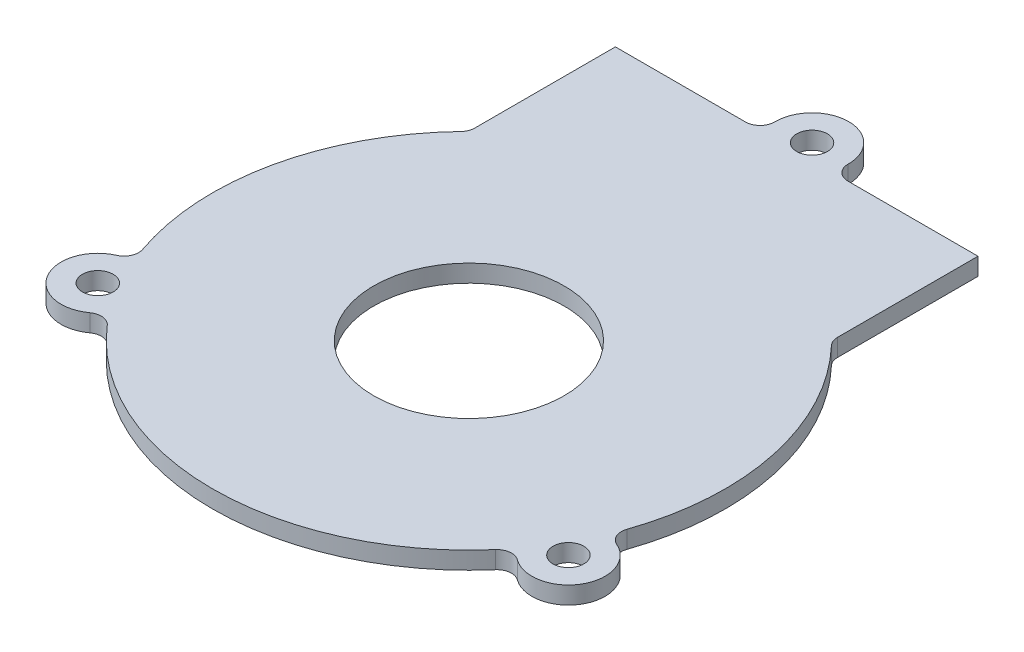
ISO-10303-21;
HEADER;
FILE_DESCRIPTION(('STEP AP214'),'2;1');
FILE_NAME('part.step','',(''),(''),'','','');
FILE_SCHEMA(('AUTOMOTIVE_DESIGN { 1 0 10303 214 1 1 1 1 }'));
ENDSEC;
DATA;
#1=APPLICATION_CONTEXT('core data for automotive mechanical design processes');
#2=APPLICATION_PROTOCOL_DEFINITION('international standard','automotive_design',2000,#1);
#3=PRODUCT_CONTEXT('',#1,'mechanical');
#4=PRODUCT('Part','Part','',(#3));
#5=PRODUCT_RELATED_PRODUCT_CATEGORY('part','',(#4));
#6=PRODUCT_DEFINITION_FORMATION('','',#4);
#7=PRODUCT_DEFINITION_CONTEXT('part definition',#1,'design');
#8=PRODUCT_DEFINITION('design','',#6,#7);
#9=PRODUCT_DEFINITION_SHAPE('','',#8);
#10=(LENGTH_UNIT() NAMED_UNIT(*) SI_UNIT(.MILLI.,.METRE.));
#11=(NAMED_UNIT(*) PLANE_ANGLE_UNIT() SI_UNIT($,.RADIAN.));
#12=(NAMED_UNIT(*) SI_UNIT($,.STERADIAN.) SOLID_ANGLE_UNIT());
#13=UNCERTAINTY_MEASURE_WITH_UNIT(LENGTH_MEASURE(1.E-05),#10,'distance_accuracy_value','');
#14=(GEOMETRIC_REPRESENTATION_CONTEXT(3) GLOBAL_UNCERTAINTY_ASSIGNED_CONTEXT((#13)) GLOBAL_UNIT_ASSIGNED_CONTEXT((#10,
#11,#12)) REPRESENTATION_CONTEXT('',''));
#15=CARTESIAN_POINT('',(0.,0.,0.));
#16=DIRECTION('',(0.,0.,1.));
#17=DIRECTION('',(1.,0.,0.));
#18=AXIS2_PLACEMENT_3D('',#15,#16,#17);
#19=CARTESIAN_POINT('',(0.,2.38125,0.));
#20=DIRECTION('',(0.,-1.,0.));
#21=DIRECTION('',(0.,0.,-1.));
#22=AXIS2_PLACEMENT_3D('',#19,#20,#21);
#23=CYLINDRICAL_SURFACE('',#22,35.);
#24=CARTESIAN_POINT('',(0.,0.,0.));
#25=DIRECTION('',(0.,1.,0.));
#26=DIRECTION('',(0.,0.,1.));
#27=AXIS2_PLACEMENT_3D('',#24,#25,#26);
#28=CIRCLE('',#27,35.);
#29=CARTESIAN_POINT('',(-25.3019754085747,0.,-24.1828459951239));
#30=VERTEX_POINT('',#29);
#31=CARTESIAN_POINT('',(-33.072840065109,0.,11.4537002766671));
#32=VERTEX_POINT('',#31);
#33=EDGE_CURVE('E211',#30,#32,#28,.T.);
#34=ORIENTED_EDGE('',*,*,#33,.T.);
#35=DIRECTION('',(0.,-1.,0.));
#36=VECTOR('',#35,1.);
#37=CARTESIAN_POINT('',(-33.072840065109,2.38125,11.4537002766671));
#38=LINE('',#37,#36);
#39=CARTESIAN_POINT('',(-33.072840065109,2.38125,11.4537002766671));
#40=VERTEX_POINT('',#39);
#41=EDGE_CURVE('E224',#32,#40,#38,.F.);
#42=ORIENTED_EDGE('',*,*,#41,.T.);
#43=CARTESIAN_POINT('',(0.,2.38125,0.));
#44=DIRECTION('',(0.,1.,0.));
#45=DIRECTION('',(0.,0.,1.));
#46=AXIS2_PLACEMENT_3D('',#43,#44,#45);
#47=CIRCLE('',#46,35.);
#48=CARTESIAN_POINT('',(-25.3019754085747,2.38125,-24.1828459951239));
#49=VERTEX_POINT('',#48);
#50=EDGE_CURVE('E205',#49,#40,#47,.T.);
#51=ORIENTED_EDGE('',*,*,#50,.F.);
#52=DIRECTION('',(0.,-1.,0.));
#53=VECTOR('',#52,1.);
#54=CARTESIAN_POINT('',(-25.3019754085747,2.38125,-24.1828459951239));
#55=LINE('',#54,#53);
#56=EDGE_CURVE('E218',#49,#30,#55,.T.);
#57=ORIENTED_EDGE('',*,*,#56,.T.);
#58=EDGE_LOOP('',(#34,#42,#51,#57));
#59=FACE_BOUND('',#58,.T.);
#60=ADVANCED_FACE('F43',(#59),#23,.T.);
#61=CARTESIAN_POINT('',(-26.5021889393046,0.,22.8611894140572));
#62=VERTEX_POINT('',#61);
#63=CARTESIAN_POINT('',(26.4887144081727,0.,22.8768006723464));
#64=VERTEX_POINT('',#63);
#65=EDGE_CURVE('E214',#62,#64,#28,.T.);
#66=ORIENTED_EDGE('',*,*,#65,.T.);
#67=DIRECTION('',(0.,-1.,0.));
#68=VECTOR('',#67,1.);
#69=CARTESIAN_POINT('',(26.4887144081726,2.38125,22.8768006723464));
#70=LINE('',#69,#68);
#71=CARTESIAN_POINT('',(26.4887144081727,2.38125,22.8768006723464));
#72=VERTEX_POINT('',#71);
#73=EDGE_CURVE('E243',#64,#72,#70,.F.);
#74=ORIENTED_EDGE('',*,*,#73,.T.);
#75=CARTESIAN_POINT('',(-26.5021889393046,2.38125,22.8611894140572));
#76=VERTEX_POINT('',#75);
#77=EDGE_CURVE('E209',#76,#72,#47,.T.);
#78=ORIENTED_EDGE('',*,*,#77,.F.);
#79=DIRECTION('',(0.,-1.,0.));
#80=VECTOR('',#79,1.);
#81=CARTESIAN_POINT('',(-26.5021889393046,2.38125,22.8611894140572));
#82=LINE('',#81,#80);
#83=EDGE_CURVE('E234',#76,#62,#82,.T.);
#84=ORIENTED_EDGE('',*,*,#83,.T.);
#85=EDGE_LOOP('',(#66,#74,#78,#84));
#86=FACE_BOUND('',#85,.T.);
#87=ADVANCED_FACE('F366',(#86),#23,.T.);
#88=CARTESIAN_POINT('',(-24.7478605121482,-53.381962685779,-44.7452325826062));
#89=DIRECTION('',(3.0206381024394E-06,0.,0.999999999995438));
#90=DIRECTION('',(0.999999999995438,0.,-3.0206381024394E-06));
#91=AXIS2_PLACEMENT_3D('',#88,#89,#90);
#92=PLANE('',#91);
#93=DIRECTION('',(0.999999999995438,0.,-3.0206381024394E-06));
#94=VECTOR('',#93,1.);
#95=CARTESIAN_POINT('',(-24.7478605121482,2.38125,-44.7452325826062));
#96=LINE('',#95,#94);
#97=CARTESIAN_POINT('',(-24.7478605121482,2.38125,-44.7452325826062));
#98=VERTEX_POINT('',#97);
#99=CARTESIAN_POINT('',(-6.99532394188785,2.38125,-44.7452862065945));
#100=VERTEX_POINT('',#99);
#101=EDGE_CURVE('E177',#98,#100,#96,.T.);
#102=ORIENTED_EDGE('',*,*,#101,.T.);
#103=DIRECTION('',(0.,1.,0.));
#104=VECTOR('',#103,1.);
#105=CARTESIAN_POINT('',(-6.99532394188785,-53.381962685779,-44.7452862065945));
#106=LINE('',#105,#104);
#107=CARTESIAN_POINT('',(-6.99532394188785,0.,-44.7452862065945));
#108=VERTEX_POINT('',#107);
#109=EDGE_CURVE('E278',#100,#108,#106,.F.);
#110=ORIENTED_EDGE('',*,*,#109,.T.);
#111=DIRECTION('',(-0.999999999995438,0.,3.0206381024394E-06));
#112=VECTOR('',#111,1.);
#113=CARTESIAN_POINT('',(-24.7478605121482,0.,-44.7452325826062));
#114=LINE('',#113,#112);
#115=CARTESIAN_POINT('',(-24.7478605121482,0.,-44.7452325826062));
#116=VERTEX_POINT('',#115);
#117=EDGE_CURVE('E198',#108,#116,#114,.T.);
#118=ORIENTED_EDGE('',*,*,#117,.T.);
#119=DIRECTION('',(0.,1.,0.));
#120=VECTOR('',#119,1.);
#121=CARTESIAN_POINT('',(-24.7478605121482,-53.381962685779,-44.7452325826062));
#122=LINE('',#121,#120);
#123=EDGE_CURVE('E194',#116,#98,#122,.T.);
#124=ORIENTED_EDGE('',*,*,#123,.T.);
#125=EDGE_LOOP('',(#102,#110,#118,#124));
#126=FACE_BOUND('',#125,.T.);
#127=ADVANCED_FACE('F284',(#126),#92,.F.);
#128=CARTESIAN_POINT('',(33.0630730181294,0.,11.4818640733046));
#129=VERTEX_POINT('',#128);
#130=CARTESIAN_POINT('',(25.3018293128609,0.,-24.1829988509046));
#131=VERTEX_POINT('',#130);
#132=EDGE_CURVE('E215',#129,#131,#28,.T.);
#133=ORIENTED_EDGE('',*,*,#132,.T.);
#134=DIRECTION('',(0.,-1.,0.));
#135=VECTOR('',#134,1.);
#136=CARTESIAN_POINT('',(25.3018293128609,2.38125,-24.1829988509046));
#137=LINE('',#136,#135);
#138=CARTESIAN_POINT('',(25.3018293128609,2.38125,-24.1829988509046));
#139=VERTEX_POINT('',#138);
#140=EDGE_CURVE('E262',#131,#139,#137,.F.);
#141=ORIENTED_EDGE('',*,*,#140,.T.);
#142=CARTESIAN_POINT('',(33.0630730181294,2.38125,11.4818640733046));
#143=VERTEX_POINT('',#142);
#144=EDGE_CURVE('E210',#143,#139,#47,.T.);
#145=ORIENTED_EDGE('',*,*,#144,.F.);
#146=DIRECTION('',(0.,-1.,0.));
#147=VECTOR('',#146,1.);
#148=CARTESIAN_POINT('',(33.0630730181294,2.38125,11.4818640733046));
#149=LINE('',#148,#147);
#150=EDGE_CURVE('E253',#143,#129,#149,.T.);
#151=ORIENTED_EDGE('',*,*,#150,.T.);
#152=EDGE_LOOP('',(#133,#141,#145,#151));
#153=FACE_BOUND('',#152,.T.);
#154=ADVANCED_FACE('F343',(#153),#23,.T.);
#155=CARTESIAN_POINT('',(0.,2.38125,0.));
#156=DIRECTION('',(0.,1.,0.));
#157=DIRECTION('',(0.,0.,1.));
#158=AXIS2_PLACEMENT_3D('',#155,#156,#157);
#159=PLANE('',#158);
#160=CARTESIAN_POINT('',(0.,2.38125,0.));
#161=DIRECTION('',(0.,1.,0.));
#162=DIRECTION('',(0.,0.,1.));
#163=AXIS2_PLACEMENT_3D('',#160,#161,#162);
#164=CIRCLE('',#163,13.);
#165=CARTESIAN_POINT('',(0.,2.38125,13.));
#166=VERTEX_POINT('',#165);
#167=EDGE_CURVE('E335',#166,#166,#164,.T.);
#168=ORIENTED_EDGE('',*,*,#167,.F.);
#169=EDGE_LOOP('',(#168));
#170=FACE_BOUND('',#169,.T.);
#171=CARTESIAN_POINT('',(-32.1480166138315,2.38125,18.5087961651664));
#172=DIRECTION('',(0.,1.,0.));
#173=DIRECTION('',(0.,0.,1.));
#174=AXIS2_PLACEMENT_3D('',#171,#172,#173);
#175=CIRCLE('',#174,2.09999999999999);
#176=CARTESIAN_POINT('',(-32.1480166138315,2.38125,20.6087961651664));
#177=VERTEX_POINT('',#176);
#178=EDGE_CURVE('E329',#177,#177,#175,.T.);
#179=ORIENTED_EDGE('',*,*,#178,.F.);
#180=EDGE_LOOP('',(#179));
#181=FACE_BOUND('',#180,.T.);
#182=DIRECTION('',(-3.02063810260161E-06,0.,-0.999999999995438));
#183=VECTOR('',#182,1.);
#184=CARTESIAN_POINT('',(-24.7478001128037,2.38125,-24.7496745347634));
#185=LINE('',#184,#183);
#186=CARTESIAN_POINT('',(-24.7478025747881,2.38125,-25.5647289504072));
#187=VERTEX_POINT('',#186);
#188=EDGE_CURVE('E195',#187,#98,#185,.T.);
#189=ORIENTED_EDGE('',*,*,#188,.F.);
#190=CARTESIAN_POINT('',(-26.747802574779,2.38125,-25.564722909131));
#191=DIRECTION('',(0.,1.,0.));
#192=DIRECTION('',(0.,0.,1.));
#193=AXIS2_PLACEMENT_3D('',#190,#191,#192);
#194=CIRCLE('',#193,2.);
#195=EDGE_CURVE('E220',#187,#49,#194,.F.);
#196=ORIENTED_EDGE('',*,*,#195,.T.);
#197=ORIENTED_EDGE('',*,*,#50,.T.);
#198=CARTESIAN_POINT('',(-34.9627166402581,2.38125,12.1081974353338));
#199=DIRECTION('',(0.,1.,0.));
#200=DIRECTION('',(0.,0.,1.));
#201=AXIS2_PLACEMENT_3D('',#198,#199,#200);
#202=CIRCLE('',#201,2.);
#203=CARTESIAN_POINT('',(-34.1580179965192,2.38125,13.9391698799011));
#204=VERTEX_POINT('',#203);
#205=EDGE_CURVE('E230',#40,#204,#202,.F.);
#206=ORIENTED_EDGE('',*,*,#205,.T.);
#207=CARTESIAN_POINT('',(-32.1464555555357,2.38125,18.5161819435163));
#208=DIRECTION('',(0.,1.,0.));
#209=DIRECTION('',(0.,0.,1.));
#210=AXIS2_PLACEMENT_3D('',#207,#208,#209);
#211=CIRCLE('',#210,4.99954226749351);
#212=CARTESIAN_POINT('',(-29.1966357044392,2.38125,22.5527628891349));
#213=VERTEX_POINT('',#212);
#214=EDGE_CURVE('E323',#204,#213,#211,.T.);
#215=ORIENTED_EDGE('',*,*,#214,.T.);
#216=CARTESIAN_POINT('',(-28.0165997358363,2.38125,24.1675430948605));
#217=DIRECTION('',(0.,1.,0.));
#218=DIRECTION('',(0.,0.,1.));
#219=AXIS2_PLACEMENT_3D('',#216,#217,#218);
#220=CIRCLE('',#219,2.);
#221=EDGE_CURVE('E241',#213,#76,#220,.F.);
#222=ORIENTED_EDGE('',*,*,#221,.T.);
#223=ORIENTED_EDGE('',*,*,#77,.T.);
#224=CARTESIAN_POINT('',(28.0023552314968,2.38125,24.1840464250519));
#225=DIRECTION('',(0.,1.,0.));
#226=DIRECTION('',(0.,0.,1.));
#227=AXIS2_PLACEMENT_3D('',#224,#225,#226);
#228=CIRCLE('',#227,2.);
#229=CARTESIAN_POINT('',(29.184359284545,2.38125,22.5707062815676));
#230=VERTEX_POINT('',#229);
#231=EDGE_CURVE('E249',#72,#230,#228,.F.);
#232=ORIENTED_EDGE('',*,*,#231,.T.);
#233=CARTESIAN_POINT('',(32.1364886347761,2.38125,18.5412879583363));
#234=DIRECTION('',(0.,1.,0.));
#235=DIRECTION('',(0.,0.,1.));
#236=AXIS2_PLACEMENT_3D('',#233,#234,#235);
#237=CIRCLE('',#236,4.9951255964279);
#238=CARTESIAN_POINT('',(34.147287178261,2.38125,13.9687647007018));
#239=VERTEX_POINT('',#238);
#240=EDGE_CURVE('E312',#230,#239,#237,.T.);
#241=ORIENTED_EDGE('',*,*,#240,.T.);
#242=CARTESIAN_POINT('',(34.9523914763083,2.38125,12.1379705917791));
#243=DIRECTION('',(0.,1.,0.));
#244=DIRECTION('',(0.,0.,1.));
#245=AXIS2_PLACEMENT_3D('',#242,#243,#244);
#246=CIRCLE('',#245,2.);
#247=EDGE_CURVE('E260',#239,#143,#246,.F.);
#248=ORIENTED_EDGE('',*,*,#247,.T.);
#249=ORIENTED_EDGE('',*,*,#144,.T.);
#250=CARTESIAN_POINT('',(26.7476481307387,2.38125,-25.5648844995277));
#251=DIRECTION('',(0.,1.,0.));
#252=DIRECTION('',(0.,0.,1.));
#253=AXIS2_PLACEMENT_3D('',#250,#251,#252);
#254=CIRCLE('',#253,2.);
#255=CARTESIAN_POINT('',(24.7476481307478,2.38125,-25.5648784582515));
#256=VERTEX_POINT('',#255);
#257=EDGE_CURVE('E185',#139,#256,#254,.F.);
#258=ORIENTED_EDGE('',*,*,#257,.T.);
#259=DIRECTION('',(-3.02063810260161E-06,0.,-0.999999999995438));
#260=VECTOR('',#259,1.);
#261=CARTESIAN_POINT('',(24.7476505927322,2.38125,-24.7498240426077));
#262=LINE('',#261,#260);
#263=CARTESIAN_POINT('',(24.7475901933877,2.38125,-44.7453820904505));
#264=VERTEX_POINT('',#263);
#265=EDGE_CURVE('E178',#256,#264,#262,.T.);
#266=ORIENTED_EDGE('',*,*,#265,.T.);
#267=CARTESIAN_POINT('',(6.99533660471705,2.38125,-44.7453284673169));
#268=VERTEX_POINT('',#267);
#269=EDGE_CURVE('E168',#268,#264,#96,.T.);
#270=ORIENTED_EDGE('',*,*,#269,.F.);
#271=CARTESIAN_POINT('',(6.99533056344084,2.38125,-46.7453284673078));
#272=DIRECTION('',(0.,1.,0.));
#273=DIRECTION('',(0.,0.,1.));
#274=AXIS2_PLACEMENT_3D('',#271,#272,#273);
#275=CIRCLE('',#274,2.);
#276=CARTESIAN_POINT('',(4.99551899083441,2.38125,-46.7727815922561));
#277=VERTEX_POINT('',#276);
#278=EDGE_CURVE('E274',#268,#277,#275,.F.);
#279=ORIENTED_EDGE('',*,*,#278,.T.);
#280=CARTESIAN_POINT('',(0.,2.38125,-46.8413593567393));
#281=DIRECTION('',(0.,1.,0.));
#282=DIRECTION('',(0.,0.,1.));
#283=AXIS2_PLACEMENT_3D('',#280,#281,#282);
#284=CIRCLE('',#283,4.99598968149142);
#285=CARTESIAN_POINT('',(-4.99551857644603,2.38125,-46.7727514129473));
#286=VERTEX_POINT('',#285);
#287=EDGE_CURVE('E304',#277,#286,#284,.T.);
#288=ORIENTED_EDGE('',*,*,#287,.T.);
#289=CARTESIAN_POINT('',(-6.99532998316405,2.38125,-46.7452862065854));
#290=DIRECTION('',(0.,1.,0.));
#291=DIRECTION('',(0.,0.,1.));
#292=AXIS2_PLACEMENT_3D('',#289,#290,#291);
#293=CIRCLE('',#292,2.);
#294=EDGE_CURVE('E12',#286,#100,#293,.F.);
#295=ORIENTED_EDGE('',*,*,#294,.T.);
#296=ORIENTED_EDGE('',*,*,#101,.F.);
#297=EDGE_LOOP('',(#189,#196,#197,#206,#215,#222,#223,#232,#241,#248,#249,#258,#266,#270,#279,
#288,#295,#296));
#298=FACE_BOUND('',#297,.T.);
#299=CARTESIAN_POINT('',(32.1247811991366,2.38125,18.5356173256723));
#300=DIRECTION('',(0.,1.,0.));
#301=DIRECTION('',(0.,0.,1.));
#302=AXIS2_PLACEMENT_3D('',#299,#300,#301);
#303=CIRCLE('',#302,2.1);
#304=CARTESIAN_POINT('',(32.1247811991366,2.38125,20.6356173256723));
#305=VERTEX_POINT('',#304);
#306=EDGE_CURVE('E318',#305,#305,#303,.T.);
#307=ORIENTED_EDGE('',*,*,#306,.F.);
#308=EDGE_LOOP('',(#307));
#309=FACE_BOUND('',#308,.T.);
#310=CARTESIAN_POINT('',(0.,2.38125,-46.8413593567393));
#311=DIRECTION('',(0.,1.,0.));
#312=DIRECTION('',(0.,0.,1.));
#313=AXIS2_PLACEMENT_3D('',#310,#311,#312);
#314=CIRCLE('',#313,2.09605202456873);
#315=CARTESIAN_POINT('',(0.,2.38125,-44.7453073321706));
#316=VERTEX_POINT('',#315);
#317=EDGE_CURVE('E306',#316,#316,#314,.T.);
#318=ORIENTED_EDGE('',*,*,#317,.F.);
#319=EDGE_LOOP('',(#318));
#320=FACE_BOUND('',#319,.T.);
#321=ADVANCED_FACE('F182',(#170,#181,#298,#309,#320),#159,.T.);
#322=CARTESIAN_POINT('',(0.,0.,0.));
#323=DIRECTION('',(0.,1.,0.));
#324=DIRECTION('',(0.,0.,1.));
#325=AXIS2_PLACEMENT_3D('',#322,#323,#324);
#326=PLANE('',#325);
#327=CARTESIAN_POINT('',(0.,0.,0.));
#328=DIRECTION('',(0.,1.,0.));
#329=DIRECTION('',(0.,0.,1.));
#330=AXIS2_PLACEMENT_3D('',#327,#328,#329);
#331=CIRCLE('',#330,13.);
#332=CARTESIAN_POINT('',(0.,0.,13.));
#333=VERTEX_POINT('',#332);
#334=EDGE_CURVE('E332',#333,#333,#331,.F.);
#335=ORIENTED_EDGE('',*,*,#334,.F.);
#336=EDGE_LOOP('',(#335));
#337=FACE_BOUND('',#336,.T.);
#338=CARTESIAN_POINT('',(-32.1480166138315,0.,18.5087961651664));
#339=DIRECTION('',(0.,1.,0.));
#340=DIRECTION('',(0.,0.,1.));
#341=AXIS2_PLACEMENT_3D('',#338,#339,#340);
#342=CIRCLE('',#341,2.1);
#343=CARTESIAN_POINT('',(-32.1480166138315,0.,20.6087961651664));
#344=VERTEX_POINT('',#343);
#345=EDGE_CURVE('E326',#344,#344,#342,.T.);
#346=ORIENTED_EDGE('',*,*,#345,.T.);
#347=EDGE_LOOP('',(#346));
#348=FACE_BOUND('',#347,.T.);
#349=CARTESIAN_POINT('',(32.1247811991366,0.,18.5356173256723));
#350=DIRECTION('',(0.,1.,0.));
#351=DIRECTION('',(0.,0.,1.));
#352=AXIS2_PLACEMENT_3D('',#349,#350,#351);
#353=CIRCLE('',#352,2.1);
#354=CARTESIAN_POINT('',(32.1247811991366,0.,20.6356173256723));
#355=VERTEX_POINT('',#354);
#356=EDGE_CURVE('E315',#355,#355,#353,.T.);
#357=ORIENTED_EDGE('',*,*,#356,.T.);
#358=EDGE_LOOP('',(#357));
#359=FACE_BOUND('',#358,.T.);
#360=CARTESIAN_POINT('',(0.,0.,-46.8413593567393));
#361=DIRECTION('',(0.,1.,0.));
#362=DIRECTION('',(0.,0.,1.));
#363=AXIS2_PLACEMENT_3D('',#360,#361,#362);
#364=CIRCLE('',#363,2.09605202456873);
#365=CARTESIAN_POINT('',(0.,0.,-44.7453073321706));
#366=VERTEX_POINT('',#365);
#367=EDGE_CURVE('E188',#366,#366,#364,.F.);
#368=ORIENTED_EDGE('',*,*,#367,.F.);
#369=EDGE_LOOP('',(#368));
#370=FACE_BOUND('',#369,.T.);
#371=ORIENTED_EDGE('',*,*,#65,.F.);
#372=CARTESIAN_POINT('',(-28.0165997358363,0.,24.1675430948605));
#373=DIRECTION('',(0.,1.,0.));
#374=DIRECTION('',(0.,0.,1.));
#375=AXIS2_PLACEMENT_3D('',#372,#373,#374);
#376=CIRCLE('',#375,2.);
#377=CARTESIAN_POINT('',(-29.1966357044392,0.,22.5527628891349));
#378=VERTEX_POINT('',#377);
#379=EDGE_CURVE('E239',#62,#378,#376,.T.);
#380=ORIENTED_EDGE('',*,*,#379,.T.);
#381=CARTESIAN_POINT('',(-32.1464555555357,0.,18.5161819435163));
#382=DIRECTION('',(0.,1.,0.));
#383=DIRECTION('',(0.,0.,1.));
#384=AXIS2_PLACEMENT_3D('',#381,#382,#383);
#385=CIRCLE('',#384,4.99954226749351);
#386=CARTESIAN_POINT('',(-34.1580179965192,0.,13.9391698799011));
#387=VERTEX_POINT('',#386);
#388=EDGE_CURVE('E321',#378,#387,#385,.F.);
#389=ORIENTED_EDGE('',*,*,#388,.T.);
#390=CARTESIAN_POINT('',(-34.9627166402581,0.,12.1081974353338));
#391=DIRECTION('',(0.,1.,0.));
#392=DIRECTION('',(0.,0.,1.));
#393=AXIS2_PLACEMENT_3D('',#390,#391,#392);
#394=CIRCLE('',#393,2.);
#395=EDGE_CURVE('E232',#387,#32,#394,.T.);
#396=ORIENTED_EDGE('',*,*,#395,.T.);
#397=ORIENTED_EDGE('',*,*,#33,.F.);
#398=CARTESIAN_POINT('',(-26.747802574779,0.,-25.564722909131));
#399=DIRECTION('',(0.,1.,0.));
#400=DIRECTION('',(0.,0.,1.));
#401=AXIS2_PLACEMENT_3D('',#398,#399,#400);
#402=CIRCLE('',#401,2.);
#403=CARTESIAN_POINT('',(-24.7478025747881,0.,-25.5647289504072));
#404=VERTEX_POINT('',#403);
#405=EDGE_CURVE('E222',#30,#404,#402,.T.);
#406=ORIENTED_EDGE('',*,*,#405,.T.);
#407=DIRECTION('',(3.02063810260161E-06,0.,0.999999999995438));
#408=VECTOR('',#407,1.);
#409=CARTESIAN_POINT('',(-24.7478001128037,0.,-24.7496745347634));
#410=LINE('',#409,#408);
#411=EDGE_CURVE('E204',#116,#404,#410,.T.);
#412=ORIENTED_EDGE('',*,*,#411,.F.);
#413=ORIENTED_EDGE('',*,*,#117,.F.);
#414=CARTESIAN_POINT('',(-6.99532998316405,0.,-46.7452862065854));
#415=DIRECTION('',(0.,1.,0.));
#416=DIRECTION('',(0.,0.,1.));
#417=AXIS2_PLACEMENT_3D('',#414,#415,#416);
#418=CIRCLE('',#417,2.);
#419=CARTESIAN_POINT('',(-4.99551857644603,0.,-46.7727514129473));
#420=VERTEX_POINT('',#419);
#421=EDGE_CURVE('E51',#108,#420,#418,.T.);
#422=ORIENTED_EDGE('',*,*,#421,.T.);
#423=CARTESIAN_POINT('',(0.,0.,-46.8413593567393));
#424=DIRECTION('',(0.,1.,0.));
#425=DIRECTION('',(0.,0.,1.));
#426=AXIS2_PLACEMENT_3D('',#423,#424,#425);
#427=CIRCLE('',#426,4.99598968149142);
#428=CARTESIAN_POINT('',(4.99551899083441,0.,-46.7727815922561));
#429=VERTEX_POINT('',#428);
#430=EDGE_CURVE('E303',#420,#429,#427,.F.);
#431=ORIENTED_EDGE('',*,*,#430,.T.);
#432=CARTESIAN_POINT('',(6.99533056344084,0.,-46.7453284673078));
#433=DIRECTION('',(0.,1.,0.));
#434=DIRECTION('',(0.,0.,1.));
#435=AXIS2_PLACEMENT_3D('',#432,#433,#434);
#436=CIRCLE('',#435,2.);
#437=CARTESIAN_POINT('',(6.99533660471705,0.,-44.7453284673169));
#438=VERTEX_POINT('',#437);
#439=EDGE_CURVE('E276',#429,#438,#436,.T.);
#440=ORIENTED_EDGE('',*,*,#439,.T.);
#441=CARTESIAN_POINT('',(24.7475901933877,0.,-44.7453820904505));
#442=VERTEX_POINT('',#441);
#443=EDGE_CURVE('E202',#442,#438,#114,.T.);
#444=ORIENTED_EDGE('',*,*,#443,.F.);
#445=DIRECTION('',(3.02063810260161E-06,0.,0.999999999995438));
#446=VECTOR('',#445,1.);
#447=CARTESIAN_POINT('',(24.7476505927322,0.,-24.7498240426077));
#448=LINE('',#447,#446);
#449=CARTESIAN_POINT('',(24.7476481307478,0.,-25.5648784582515));
#450=VERTEX_POINT('',#449);
#451=EDGE_CURVE('E193',#442,#450,#448,.T.);
#452=ORIENTED_EDGE('',*,*,#451,.T.);
#453=CARTESIAN_POINT('',(26.7476481307387,0.,-25.5648844995277));
#454=DIRECTION('',(0.,1.,0.));
#455=DIRECTION('',(0.,0.,1.));
#456=AXIS2_PLACEMENT_3D('',#453,#454,#455);
#457=CIRCLE('',#456,2.);
#458=EDGE_CURVE('E268',#450,#131,#457,.T.);
#459=ORIENTED_EDGE('',*,*,#458,.T.);
#460=ORIENTED_EDGE('',*,*,#132,.F.);
#461=CARTESIAN_POINT('',(34.9523914763083,0.,12.1379705917791));
#462=DIRECTION('',(0.,1.,0.));
#463=DIRECTION('',(0.,0.,1.));
#464=AXIS2_PLACEMENT_3D('',#461,#462,#463);
#465=CIRCLE('',#464,2.);
#466=CARTESIAN_POINT('',(34.147287178261,0.,13.9687647007018));
#467=VERTEX_POINT('',#466);
#468=EDGE_CURVE('E258',#129,#467,#465,.T.);
#469=ORIENTED_EDGE('',*,*,#468,.T.);
#470=CARTESIAN_POINT('',(32.1364886347761,0.,18.5412879583363));
#471=DIRECTION('',(0.,1.,0.));
#472=DIRECTION('',(0.,0.,1.));
#473=AXIS2_PLACEMENT_3D('',#470,#471,#472);
#474=CIRCLE('',#473,4.9951255964279);
#475=CARTESIAN_POINT('',(29.184359284545,0.,22.5707062815676));
#476=VERTEX_POINT('',#475);
#477=EDGE_CURVE('E309',#467,#476,#474,.F.);
#478=ORIENTED_EDGE('',*,*,#477,.T.);
#479=CARTESIAN_POINT('',(28.0023552314968,0.,24.1840464250519));
#480=DIRECTION('',(0.,1.,0.));
#481=DIRECTION('',(0.,0.,1.));
#482=AXIS2_PLACEMENT_3D('',#479,#480,#481);
#483=CIRCLE('',#482,2.);
#484=EDGE_CURVE('E251',#476,#64,#483,.T.);
#485=ORIENTED_EDGE('',*,*,#484,.T.);
#486=EDGE_LOOP('',(#371,#380,#389,#396,#397,#406,#412,#413,#422,#431,#440,#444,#452,#459,#460,
#469,#478,#485));
#487=FACE_BOUND('',#486,.T.);
#488=ADVANCED_FACE('F290',(#337,#348,#359,#370,#487),#326,.F.);
#489=ORIENTED_EDGE('',*,*,#443,.T.);
#490=DIRECTION('',(0.,1.,0.));
#491=VECTOR('',#490,1.);
#492=CARTESIAN_POINT('',(6.99533660471705,-53.381962685779,-44.7453284673169));
#493=LINE('',#492,#491);
#494=EDGE_CURVE('E175',#438,#268,#493,.T.);
#495=ORIENTED_EDGE('',*,*,#494,.T.);
#496=ORIENTED_EDGE('',*,*,#269,.T.);
#497=DIRECTION('',(0.,1.,0.));
#498=VECTOR('',#497,1.);
#499=CARTESIAN_POINT('',(24.7475901933877,-53.381962685779,-44.7453820904505));
#500=LINE('',#499,#498);
#501=EDGE_CURVE('E173',#442,#264,#500,.T.);
#502=ORIENTED_EDGE('',*,*,#501,.F.);
#503=EDGE_LOOP('',(#489,#495,#496,#502));
#504=FACE_BOUND('',#503,.T.);
#505=ADVANCED_FACE('F171',(#504),#92,.F.);
#506=CARTESIAN_POINT('',(-24.7478001128037,-53.381962685779,-24.7496745347634));
#507=DIRECTION('',(0.999999999995438,0.,-3.02063810260161E-06));
#508=DIRECTION('',(-3.02063810260161E-06,0.,-0.999999999995438));
#509=AXIS2_PLACEMENT_3D('',#506,#507,#508);
#510=PLANE('',#509);
#511=ORIENTED_EDGE('',*,*,#411,.T.);
#512=DIRECTION('',(0.,1.,0.));
#513=VECTOR('',#512,1.);
#514=CARTESIAN_POINT('',(-24.7478025747881,2.38125,-25.5647289504072));
#515=LINE('',#514,#513);
#516=EDGE_CURVE('E208',#404,#187,#515,.T.);
#517=ORIENTED_EDGE('',*,*,#516,.T.);
#518=ORIENTED_EDGE('',*,*,#188,.T.);
#519=ORIENTED_EDGE('',*,*,#123,.F.);
#520=EDGE_LOOP('',(#511,#517,#518,#519));
#521=FACE_BOUND('',#520,.T.);
#522=ADVANCED_FACE('F298',(#521),#510,.F.);
#523=CARTESIAN_POINT('',(24.7476505927322,-53.381962685779,-24.7498240426077));
#524=DIRECTION('',(0.999999999995438,0.,-3.02063810260161E-06));
#525=DIRECTION('',(-3.02063810260161E-06,0.,-0.999999999995438));
#526=AXIS2_PLACEMENT_3D('',#523,#524,#525);
#527=PLANE('',#526);
#528=ORIENTED_EDGE('',*,*,#265,.F.);
#529=DIRECTION('',(0.,-1.,0.));
#530=VECTOR('',#529,1.);
#531=CARTESIAN_POINT('',(24.7476481307478,-53.381962685779,-25.5648784582515));
#532=LINE('',#531,#530);
#533=EDGE_CURVE('E265',#256,#450,#532,.T.);
#534=ORIENTED_EDGE('',*,*,#533,.T.);
#535=ORIENTED_EDGE('',*,*,#451,.F.);
#536=ORIENTED_EDGE('',*,*,#501,.T.);
#537=EDGE_LOOP('',(#528,#534,#535,#536));
#538=FACE_BOUND('',#537,.T.);
#539=ADVANCED_FACE('F191',(#538),#527,.T.);
#540=CARTESIAN_POINT('',(0.,-14.1307927300824,-46.8413593567393));
#541=DIRECTION('',(0.,1.,0.));
#542=DIRECTION('',(0.,0.,1.));
#543=AXIS2_PLACEMENT_3D('',#540,#541,#542);
#544=CYLINDRICAL_SURFACE('',#543,4.99598968149142);
#545=ORIENTED_EDGE('',*,*,#430,.F.);
#546=DIRECTION('',(0.,1.,0.));
#547=VECTOR('',#546,1.);
#548=CARTESIAN_POINT('',(-4.99551857644604,-14.1307927300824,-46.7727514129473));
#549=LINE('',#548,#547);
#550=EDGE_CURVE('E64',#420,#286,#549,.T.);
#551=ORIENTED_EDGE('',*,*,#550,.T.);
#552=ORIENTED_EDGE('',*,*,#287,.F.);
#553=DIRECTION('',(0.,1.,0.));
#554=VECTOR('',#553,1.);
#555=CARTESIAN_POINT('',(4.99551899083441,-14.1307927300824,-46.7727815922561));
#556=LINE('',#555,#554);
#557=EDGE_CURVE('E271',#277,#429,#556,.F.);
#558=ORIENTED_EDGE('',*,*,#557,.T.);
#559=EDGE_LOOP('',(#545,#551,#552,#558));
#560=FACE_BOUND('',#559,.T.);
#561=ADVANCED_FACE('F392',(#560),#544,.T.);
#562=CARTESIAN_POINT('',(0.,-14.1307927300824,-46.8413593567393));
#563=DIRECTION('',(0.,1.,0.));
#564=DIRECTION('',(0.,0.,1.));
#565=AXIS2_PLACEMENT_3D('',#562,#563,#564);
#566=CYLINDRICAL_SURFACE('',#565,2.09605202456873);
#567=ORIENTED_EDGE('',*,*,#317,.T.);
#568=EDGE_LOOP('',(#567));
#569=FACE_BOUND('',#568,.T.);
#570=ORIENTED_EDGE('',*,*,#367,.T.);
#571=EDGE_LOOP('',(#570));
#572=FACE_BOUND('',#571,.T.);
#573=ADVANCED_FACE('F443',(#569,#572),#566,.F.);
#574=CARTESIAN_POINT('',(32.1364886347761,-14.1283487284507,18.5412879583363));
#575=DIRECTION('',(0.,1.,0.));
#576=DIRECTION('',(0.,0.,1.));
#577=AXIS2_PLACEMENT_3D('',#574,#575,#576);
#578=CYLINDRICAL_SURFACE('',#577,4.9951255964279);
#579=ORIENTED_EDGE('',*,*,#477,.F.);
#580=DIRECTION('',(0.,1.,0.));
#581=VECTOR('',#580,1.);
#582=CARTESIAN_POINT('',(34.147287178261,-14.1283487284507,13.9687647007018));
#583=LINE('',#582,#581);
#584=EDGE_CURVE('E256',#467,#239,#583,.T.);
#585=ORIENTED_EDGE('',*,*,#584,.T.);
#586=ORIENTED_EDGE('',*,*,#240,.F.);
#587=DIRECTION('',(0.,1.,0.));
#588=VECTOR('',#587,1.);
#589=CARTESIAN_POINT('',(29.184359284545,-14.1283487284507,22.5707062815676));
#590=LINE('',#589,#588);
#591=EDGE_CURVE('E246',#230,#476,#590,.F.);
#592=ORIENTED_EDGE('',*,*,#591,.T.);
#593=EDGE_LOOP('',(#579,#585,#586,#592));
#594=FACE_BOUND('',#593,.T.);
#595=ADVANCED_FACE('F438',(#594),#578,.T.);
#596=CARTESIAN_POINT('',(32.1247811991366,2.38125,18.5356173256723));
#597=DIRECTION('',(0.,1.,0.));
#598=DIRECTION('',(0.,0.,1.));
#599=AXIS2_PLACEMENT_3D('',#596,#597,#598);
#600=CYLINDRICAL_SURFACE('',#599,2.1);
#601=ORIENTED_EDGE('',*,*,#356,.F.);
#602=EDGE_LOOP('',(#601));
#603=FACE_BOUND('',#602,.T.);
#604=ORIENTED_EDGE('',*,*,#306,.T.);
#605=EDGE_LOOP('',(#604));
#606=FACE_BOUND('',#605,.T.);
#607=ADVANCED_FACE('F360',(#603,#606),#600,.F.);
#608=CARTESIAN_POINT('',(-32.1464555555357,-14.1408409606937,18.5161819435163));
#609=DIRECTION('',(0.,1.,0.));
#610=DIRECTION('',(0.,0.,1.));
#611=AXIS2_PLACEMENT_3D('',#608,#609,#610);
#612=CYLINDRICAL_SURFACE('',#611,4.99954226749351);
#613=ORIENTED_EDGE('',*,*,#388,.F.);
#614=DIRECTION('',(0.,1.,0.));
#615=VECTOR('',#614,1.);
#616=CARTESIAN_POINT('',(-29.1966357044392,-14.1408409606937,22.5527628891349));
#617=LINE('',#616,#615);
#618=EDGE_CURVE('E237',#378,#213,#617,.T.);
#619=ORIENTED_EDGE('',*,*,#618,.T.);
#620=ORIENTED_EDGE('',*,*,#214,.F.);
#621=DIRECTION('',(0.,1.,0.));
#622=VECTOR('',#621,1.);
#623=CARTESIAN_POINT('',(-34.1580179965192,-14.1408409606937,13.9391698799011));
#624=LINE('',#623,#622);
#625=EDGE_CURVE('E227',#204,#387,#624,.F.);
#626=ORIENTED_EDGE('',*,*,#625,.T.);
#627=EDGE_LOOP('',(#613,#619,#620,#626));
#628=FACE_BOUND('',#627,.T.);
#629=ADVANCED_FACE('F350',(#628),#612,.T.);
#630=CARTESIAN_POINT('',(-32.1480166138315,2.38125,18.5087961651664));
#631=DIRECTION('',(0.,1.,0.));
#632=DIRECTION('',(0.,0.,1.));
#633=AXIS2_PLACEMENT_3D('',#630,#631,#632);
#634=CYLINDRICAL_SURFACE('',#633,2.09999999999999);
#635=ORIENTED_EDGE('',*,*,#345,.F.);
#636=EDGE_LOOP('',(#635));
#637=FACE_BOUND('',#636,.T.);
#638=ORIENTED_EDGE('',*,*,#178,.T.);
#639=EDGE_LOOP('',(#638));
#640=FACE_BOUND('',#639,.T.);
#641=ADVANCED_FACE('F347',(#637,#640),#634,.F.);
#642=CARTESIAN_POINT('',(-26.747802574779,2.38125,-25.564722909131));
#643=DIRECTION('',(0.,-1.,0.));
#644=DIRECTION('',(0.,0.,-1.));
#645=AXIS2_PLACEMENT_3D('',#642,#643,#644);
#646=CYLINDRICAL_SURFACE('',#645,2.);
#647=ORIENTED_EDGE('',*,*,#405,.F.);
#648=ORIENTED_EDGE('',*,*,#56,.F.);
#649=ORIENTED_EDGE('',*,*,#195,.F.);
#650=ORIENTED_EDGE('',*,*,#516,.F.);
#651=EDGE_LOOP('',(#647,#648,#649,#650));
#652=FACE_BOUND('',#651,.T.);
#653=ADVANCED_FACE('F349',(#652),#646,.F.);
#654=CARTESIAN_POINT('',(-34.9627166402581,-14.1408409606937,12.1081974353338));
#655=DIRECTION('',(0.,-1.,0.));
#656=DIRECTION('',(0.,0.,-1.));
#657=AXIS2_PLACEMENT_3D('',#654,#655,#656);
#658=CYLINDRICAL_SURFACE('',#657,2.);
#659=ORIENTED_EDGE('',*,*,#395,.F.);
#660=ORIENTED_EDGE('',*,*,#625,.F.);
#661=ORIENTED_EDGE('',*,*,#205,.F.);
#662=ORIENTED_EDGE('',*,*,#41,.F.);
#663=EDGE_LOOP('',(#659,#660,#661,#662));
#664=FACE_BOUND('',#663,.T.);
#665=ADVANCED_FACE('F357',(#664),#658,.F.);
#666=CARTESIAN_POINT('',(-28.0165997358363,-14.1408409606937,24.1675430948605));
#667=DIRECTION('',(0.,1.,0.));
#668=DIRECTION('',(0.,0.,1.));
#669=AXIS2_PLACEMENT_3D('',#666,#667,#668);
#670=CYLINDRICAL_SURFACE('',#669,2.);
#671=ORIENTED_EDGE('',*,*,#221,.F.);
#672=ORIENTED_EDGE('',*,*,#618,.F.);
#673=ORIENTED_EDGE('',*,*,#379,.F.);
#674=ORIENTED_EDGE('',*,*,#83,.F.);
#675=EDGE_LOOP('',(#671,#672,#673,#674));
#676=FACE_BOUND('',#675,.T.);
#677=ADVANCED_FACE('F411',(#676),#670,.F.);
#678=CARTESIAN_POINT('',(28.0023552314968,-14.1283487284507,24.1840464250519));
#679=DIRECTION('',(0.,-1.,0.));
#680=DIRECTION('',(0.,0.,-1.));
#681=AXIS2_PLACEMENT_3D('',#678,#679,#680);
#682=CYLINDRICAL_SURFACE('',#681,2.);
#683=ORIENTED_EDGE('',*,*,#484,.F.);
#684=ORIENTED_EDGE('',*,*,#591,.F.);
#685=ORIENTED_EDGE('',*,*,#231,.F.);
#686=ORIENTED_EDGE('',*,*,#73,.F.);
#687=EDGE_LOOP('',(#683,#684,#685,#686));
#688=FACE_BOUND('',#687,.T.);
#689=ADVANCED_FACE('F407',(#688),#682,.F.);
#690=CARTESIAN_POINT('',(34.9523914763083,-14.1283487284507,12.1379705917791));
#691=DIRECTION('',(0.,1.,0.));
#692=DIRECTION('',(0.,0.,1.));
#693=AXIS2_PLACEMENT_3D('',#690,#691,#692);
#694=CYLINDRICAL_SURFACE('',#693,2.);
#695=ORIENTED_EDGE('',*,*,#247,.F.);
#696=ORIENTED_EDGE('',*,*,#584,.F.);
#697=ORIENTED_EDGE('',*,*,#468,.F.);
#698=ORIENTED_EDGE('',*,*,#150,.F.);
#699=EDGE_LOOP('',(#695,#696,#697,#698));
#700=FACE_BOUND('',#699,.T.);
#701=ADVANCED_FACE('F402',(#700),#694,.F.);
#702=CARTESIAN_POINT('',(26.7476481307387,2.38125,-25.5648844995277));
#703=DIRECTION('',(0.,-1.,0.));
#704=DIRECTION('',(0.,0.,-1.));
#705=AXIS2_PLACEMENT_3D('',#702,#703,#704);
#706=CYLINDRICAL_SURFACE('',#705,2.);
#707=ORIENTED_EDGE('',*,*,#458,.F.);
#708=ORIENTED_EDGE('',*,*,#533,.F.);
#709=ORIENTED_EDGE('',*,*,#257,.F.);
#710=ORIENTED_EDGE('',*,*,#140,.F.);
#711=EDGE_LOOP('',(#707,#708,#709,#710));
#712=FACE_BOUND('',#711,.T.);
#713=ADVANCED_FACE('F387',(#712),#706,.F.);
#714=CARTESIAN_POINT('',(6.99533056344084,-14.1307927300824,-46.7453284673078));
#715=DIRECTION('',(0.,1.,0.));
#716=DIRECTION('',(0.,0.,1.));
#717=AXIS2_PLACEMENT_3D('',#714,#715,#716);
#718=CYLINDRICAL_SURFACE('',#717,2.);
#719=ORIENTED_EDGE('',*,*,#439,.F.);
#720=ORIENTED_EDGE('',*,*,#557,.F.);
#721=ORIENTED_EDGE('',*,*,#278,.F.);
#722=ORIENTED_EDGE('',*,*,#494,.F.);
#723=EDGE_LOOP('',(#719,#720,#721,#722));
#724=FACE_BOUND('',#723,.T.);
#725=ADVANCED_FACE('F390',(#724),#718,.F.);
#726=CARTESIAN_POINT('',(-6.99532998316405,-14.1307927300824,-46.7452862065854));
#727=DIRECTION('',(0.,1.,0.));
#728=DIRECTION('',(0.,0.,1.));
#729=AXIS2_PLACEMENT_3D('',#726,#727,#728);
#730=CYLINDRICAL_SURFACE('',#729,2.);
#731=ORIENTED_EDGE('',*,*,#294,.F.);
#732=ORIENTED_EDGE('',*,*,#550,.F.);
#733=ORIENTED_EDGE('',*,*,#421,.F.);
#734=ORIENTED_EDGE('',*,*,#109,.F.);
#735=EDGE_LOOP('',(#731,#732,#733,#734));
#736=FACE_BOUND('',#735,.T.);
#737=ADVANCED_FACE('F45',(#736),#730,.F.);
#738=CARTESIAN_POINT('',(0.,-36.7695526217005,0.));
#739=DIRECTION('',(0.,1.,0.));
#740=DIRECTION('',(0.,0.,1.));
#741=AXIS2_PLACEMENT_3D('',#738,#739,#740);
#742=CYLINDRICAL_SURFACE('',#741,13.);
#743=ORIENTED_EDGE('',*,*,#334,.T.);
#744=EDGE_LOOP('',(#743));
#745=FACE_BOUND('',#744,.T.);
#746=ORIENTED_EDGE('',*,*,#167,.T.);
#747=EDGE_LOOP('',(#746));
#748=FACE_BOUND('',#747,.T.);
#749=ADVANCED_FACE('F339',(#745,#748),#742,.F.);
#750=CLOSED_SHELL('',(#60,#87,#127,#154,#321,#488,#505,#522,#539,#561,#573,#595,#607,#629,#641,
#653,#665,#677,#689,#701,#713,#725,#737,#749));
#751=MANIFOLD_SOLID_BREP('B2',#750);
#752=ADVANCED_BREP_SHAPE_REPRESENTATION('',(#18,#751),#14);
#753=SHAPE_DEFINITION_REPRESENTATION(#9,#752);
ENDSEC;
END-ISO-10303-21;
